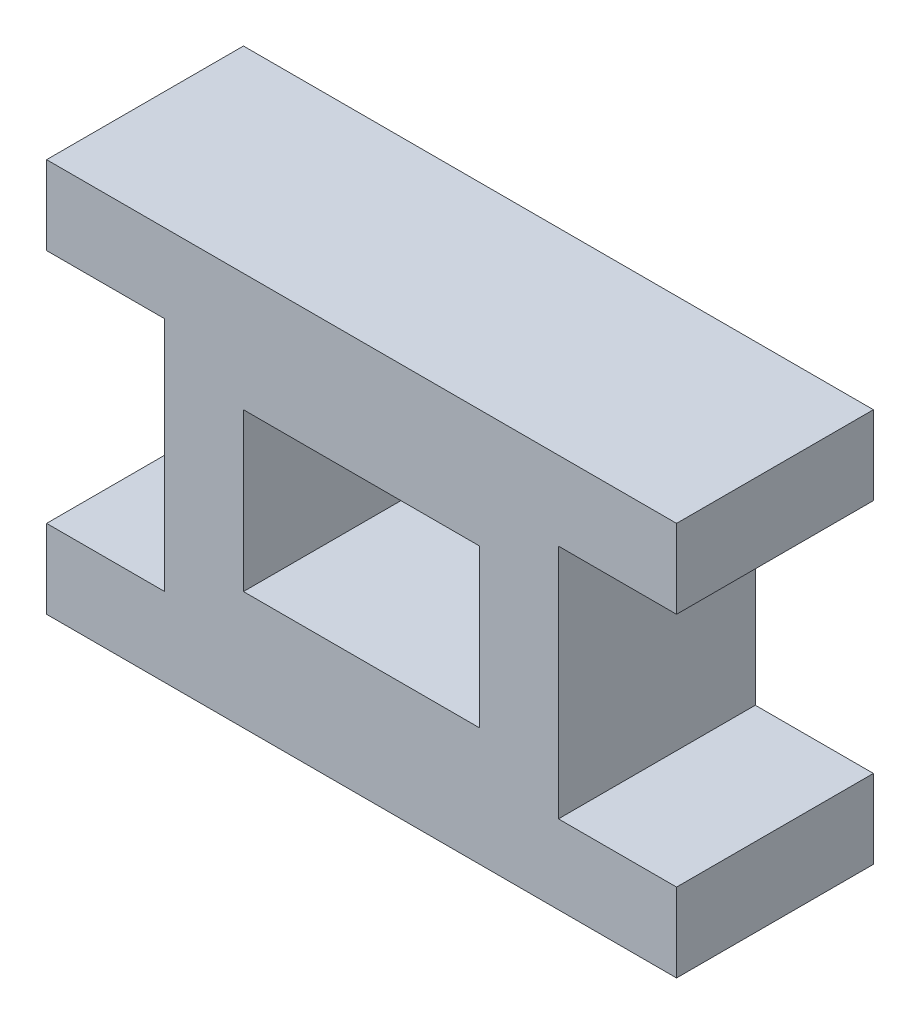
ISO-10303-21;
HEADER;
FILE_DESCRIPTION(('STEP AP214'),'2;1');
FILE_NAME('part.step','',(''),(''),'','','');
FILE_SCHEMA(('AUTOMOTIVE_DESIGN { 1 0 10303 214 1 1 1 1 }'));
ENDSEC;
DATA;
#1=APPLICATION_CONTEXT('core data for automotive mechanical design processes');
#2=APPLICATION_PROTOCOL_DEFINITION('international standard','automotive_design',2000,#1);
#3=PRODUCT_CONTEXT('',#1,'mechanical');
#4=PRODUCT('Part','Part','',(#3));
#5=PRODUCT_RELATED_PRODUCT_CATEGORY('part','',(#4));
#6=PRODUCT_DEFINITION_FORMATION('','',#4);
#7=PRODUCT_DEFINITION_CONTEXT('part definition',#1,'design');
#8=PRODUCT_DEFINITION('design','',#6,#7);
#9=PRODUCT_DEFINITION_SHAPE('','',#8);
#10=(LENGTH_UNIT() NAMED_UNIT(*) SI_UNIT(.MILLI.,.METRE.));
#11=(NAMED_UNIT(*) PLANE_ANGLE_UNIT() SI_UNIT($,.RADIAN.));
#12=(NAMED_UNIT(*) SI_UNIT($,.STERADIAN.) SOLID_ANGLE_UNIT());
#13=UNCERTAINTY_MEASURE_WITH_UNIT(LENGTH_MEASURE(1.E-05),#10,'distance_accuracy_value','');
#14=(GEOMETRIC_REPRESENTATION_CONTEXT(3) GLOBAL_UNCERTAINTY_ASSIGNED_CONTEXT((#13)) GLOBAL_UNIT_ASSIGNED_CONTEXT((#10,
#11,#12)) REPRESENTATION_CONTEXT('',''));
#15=CARTESIAN_POINT('',(0.,0.,0.));
#16=DIRECTION('',(0.,0.,1.));
#17=DIRECTION('',(1.,0.,0.));
#18=AXIS2_PLACEMENT_3D('',#15,#16,#17);
#19=CARTESIAN_POINT('',(0.,0.,25.));
#20=DIRECTION('',(0.,0.,-1.));
#21=DIRECTION('',(-1.,0.,0.));
#22=AXIS2_PLACEMENT_3D('',#19,#20,#21);
#23=PLANE('',#22);
#24=DIRECTION('',(-1.,0.,0.));
#25=VECTOR('',#24,1.);
#26=CARTESIAN_POINT('',(40.,-11.936936627637,25.));
#27=LINE('',#26,#25);
#28=CARTESIAN_POINT('',(40.,-11.936936627637,25.));
#29=VERTEX_POINT('',#28);
#30=CARTESIAN_POINT('',(25.,-11.936936627637,25.));
#31=VERTEX_POINT('',#30);
#32=EDGE_CURVE('E182',#29,#31,#27,.T.);
#33=ORIENTED_EDGE('',*,*,#32,.T.);
#34=DIRECTION('',(0.,1.,0.));
#35=VECTOR('',#34,1.);
#36=CARTESIAN_POINT('',(25.,-11.936936627637,25.));
#37=LINE('',#36,#35);
#38=CARTESIAN_POINT('',(25.,18.063063372363,25.));
#39=VERTEX_POINT('',#38);
#40=EDGE_CURVE('E185',#31,#39,#37,.T.);
#41=ORIENTED_EDGE('',*,*,#40,.T.);
#42=DIRECTION('',(1.,0.,0.));
#43=VECTOR('',#42,1.);
#44=CARTESIAN_POINT('',(25.,18.063063372363,25.));
#45=LINE('',#44,#43);
#46=CARTESIAN_POINT('',(40.,18.063063372363,25.));
#47=VERTEX_POINT('',#46);
#48=EDGE_CURVE('E188',#39,#47,#45,.T.);
#49=ORIENTED_EDGE('',*,*,#48,.T.);
#50=DIRECTION('',(0.,1.,0.));
#51=VECTOR('',#50,1.);
#52=CARTESIAN_POINT('',(40.,18.063063372363,25.));
#53=LINE('',#52,#51);
#54=CARTESIAN_POINT('',(40.,28.063063372363,25.));
#55=VERTEX_POINT('',#54);
#56=EDGE_CURVE('E190',#47,#55,#53,.T.);
#57=ORIENTED_EDGE('',*,*,#56,.T.);
#58=DIRECTION('',(-1.,0.,0.));
#59=VECTOR('',#58,1.);
#60=CARTESIAN_POINT('',(40.,28.063063372363,25.));
#61=LINE('',#60,#59);
#62=CARTESIAN_POINT('',(-40.,28.063063372363,25.));
#63=VERTEX_POINT('',#62);
#64=EDGE_CURVE('E192',#55,#63,#61,.T.);
#65=ORIENTED_EDGE('',*,*,#64,.T.);
#66=DIRECTION('',(0.,-1.,0.));
#67=VECTOR('',#66,1.);
#68=CARTESIAN_POINT('',(-40.,18.063063372363,25.));
#69=LINE('',#68,#67);
#70=CARTESIAN_POINT('',(-40.,18.063063372363,25.));
#71=VERTEX_POINT('',#70);
#72=EDGE_CURVE('E194',#63,#71,#69,.T.);
#73=ORIENTED_EDGE('',*,*,#72,.T.);
#74=DIRECTION('',(1.,0.,0.));
#75=VECTOR('',#74,1.);
#76=CARTESIAN_POINT('',(-25.,18.063063372363,25.));
#77=LINE('',#76,#75);
#78=CARTESIAN_POINT('',(-25.,18.063063372363,25.));
#79=VERTEX_POINT('',#78);
#80=EDGE_CURVE('E196',#71,#79,#77,.T.);
#81=ORIENTED_EDGE('',*,*,#80,.T.);
#82=DIRECTION('',(0.,-1.,0.));
#83=VECTOR('',#82,1.);
#84=CARTESIAN_POINT('',(-25.,-11.936936627637,25.));
#85=LINE('',#84,#83);
#86=CARTESIAN_POINT('',(-25.,-11.936936627637,25.));
#87=VERTEX_POINT('',#86);
#88=EDGE_CURVE('E198',#79,#87,#85,.T.);
#89=ORIENTED_EDGE('',*,*,#88,.T.);
#90=DIRECTION('',(-1.,0.,0.));
#91=VECTOR('',#90,1.);
#92=CARTESIAN_POINT('',(-40.,-11.936936627637,25.));
#93=LINE('',#92,#91);
#94=CARTESIAN_POINT('',(-40.,-11.936936627637,25.));
#95=VERTEX_POINT('',#94);
#96=EDGE_CURVE('E200',#87,#95,#93,.T.);
#97=ORIENTED_EDGE('',*,*,#96,.T.);
#98=DIRECTION('',(0.,-1.,0.));
#99=VECTOR('',#98,1.);
#100=CARTESIAN_POINT('',(-40.,-21.936936627637,25.));
#101=LINE('',#100,#99);
#102=CARTESIAN_POINT('',(-40.,-21.936936627637,25.));
#103=VERTEX_POINT('',#102);
#104=EDGE_CURVE('E202',#95,#103,#101,.T.);
#105=ORIENTED_EDGE('',*,*,#104,.T.);
#106=DIRECTION('',(1.,0.,0.));
#107=VECTOR('',#106,1.);
#108=CARTESIAN_POINT('',(-40.,-21.936936627637,25.));
#109=LINE('',#108,#107);
#110=CARTESIAN_POINT('',(40.,-21.936936627637,25.));
#111=VERTEX_POINT('',#110);
#112=EDGE_CURVE('E204',#103,#111,#109,.T.);
#113=ORIENTED_EDGE('',*,*,#112,.T.);
#114=DIRECTION('',(0.,1.,0.));
#115=VECTOR('',#114,1.);
#116=CARTESIAN_POINT('',(40.,-21.936936627637,25.));
#117=LINE('',#116,#115);
#118=EDGE_CURVE('E206',#111,#29,#117,.T.);
#119=ORIENTED_EDGE('',*,*,#118,.T.);
#120=EDGE_LOOP('',(#33,#41,#49,#57,#65,#73,#81,#89,#97,#105,#113,#119));
#121=FACE_BOUND('',#120,.T.);
#122=DIRECTION('',(0.,1.,0.));
#123=VECTOR('',#122,1.);
#124=CARTESIAN_POINT('',(15.,13.063063372363,25.));
#125=LINE('',#124,#123);
#126=CARTESIAN_POINT('',(15.,-6.93693662763698,25.));
#127=VERTEX_POINT('',#126);
#128=CARTESIAN_POINT('',(15.,13.063063372363,25.));
#129=VERTEX_POINT('',#128);
#130=EDGE_CURVE('E146',#127,#129,#125,.T.);
#131=ORIENTED_EDGE('',*,*,#130,.F.);
#132=DIRECTION('',(1.,0.,0.));
#133=VECTOR('',#132,1.);
#134=CARTESIAN_POINT('',(15.,-6.93693662763698,25.));
#135=LINE('',#134,#133);
#136=CARTESIAN_POINT('',(-15.,-6.93693662763699,25.));
#137=VERTEX_POINT('',#136);
#138=EDGE_CURVE('E168',#137,#127,#135,.T.);
#139=ORIENTED_EDGE('',*,*,#138,.F.);
#140=DIRECTION('',(0.,-1.,0.));
#141=VECTOR('',#140,1.);
#142=CARTESIAN_POINT('',(-15.,13.063063372363,25.));
#143=LINE('',#142,#141);
#144=CARTESIAN_POINT('',(-15.,13.063063372363,25.));
#145=VERTEX_POINT('',#144);
#146=EDGE_CURVE('E166',#145,#137,#143,.T.);
#147=ORIENTED_EDGE('',*,*,#146,.F.);
#148=DIRECTION('',(-1.,0.,0.));
#149=VECTOR('',#148,1.);
#150=CARTESIAN_POINT('',(-15.,13.063063372363,25.));
#151=LINE('',#150,#149);
#152=EDGE_CURVE('E154',#129,#145,#151,.T.);
#153=ORIENTED_EDGE('',*,*,#152,.F.);
#154=EDGE_LOOP('',(#131,#139,#147,#153));
#155=FACE_BOUND('',#154,.T.);
#156=ADVANCED_FACE('F33',(#121,#155),#23,.F.);
#157=CARTESIAN_POINT('',(0.,0.,0.));
#158=DIRECTION('',(0.,0.,-1.));
#159=DIRECTION('',(-1.,0.,0.));
#160=AXIS2_PLACEMENT_3D('',#157,#158,#159);
#161=PLANE('',#160);
#162=DIRECTION('',(-1.,0.,0.));
#163=VECTOR('',#162,1.);
#164=CARTESIAN_POINT('',(40.,-11.936936627637,0.));
#165=LINE('',#164,#163);
#166=CARTESIAN_POINT('',(40.,-11.936936627637,0.));
#167=VERTEX_POINT('',#166);
#168=CARTESIAN_POINT('',(25.,-11.936936627637,0.));
#169=VERTEX_POINT('',#168);
#170=EDGE_CURVE('E162',#167,#169,#165,.T.);
#171=ORIENTED_EDGE('',*,*,#170,.F.);
#172=DIRECTION('',(0.,1.,0.));
#173=VECTOR('',#172,1.);
#174=CARTESIAN_POINT('',(40.,-21.936936627637,0.));
#175=LINE('',#174,#173);
#176=CARTESIAN_POINT('',(40.,-21.936936627637,0.));
#177=VERTEX_POINT('',#176);
#178=EDGE_CURVE('E186',#177,#167,#175,.T.);
#179=ORIENTED_EDGE('',*,*,#178,.F.);
#180=DIRECTION('',(1.,0.,0.));
#181=VECTOR('',#180,1.);
#182=CARTESIAN_POINT('',(-40.,-21.936936627637,0.));
#183=LINE('',#182,#181);
#184=CARTESIAN_POINT('',(-40.,-21.936936627637,0.));
#185=VERTEX_POINT('',#184);
#186=EDGE_CURVE('E229',#185,#177,#183,.T.);
#187=ORIENTED_EDGE('',*,*,#186,.F.);
#188=DIRECTION('',(0.,-1.,0.));
#189=VECTOR('',#188,1.);
#190=CARTESIAN_POINT('',(-40.,-21.936936627637,0.));
#191=LINE('',#190,#189);
#192=CARTESIAN_POINT('',(-40.,-11.936936627637,0.));
#193=VERTEX_POINT('',#192);
#194=EDGE_CURVE('E227',#193,#185,#191,.T.);
#195=ORIENTED_EDGE('',*,*,#194,.F.);
#196=DIRECTION('',(-1.,0.,0.));
#197=VECTOR('',#196,1.);
#198=CARTESIAN_POINT('',(-40.,-11.936936627637,0.));
#199=LINE('',#198,#197);
#200=CARTESIAN_POINT('',(-25.,-11.936936627637,0.));
#201=VERTEX_POINT('',#200);
#202=EDGE_CURVE('E225',#201,#193,#199,.T.);
#203=ORIENTED_EDGE('',*,*,#202,.F.);
#204=DIRECTION('',(0.,-1.,0.));
#205=VECTOR('',#204,1.);
#206=CARTESIAN_POINT('',(-25.,-11.936936627637,0.));
#207=LINE('',#206,#205);
#208=CARTESIAN_POINT('',(-25.,18.063063372363,0.));
#209=VERTEX_POINT('',#208);
#210=EDGE_CURVE('E223',#209,#201,#207,.T.);
#211=ORIENTED_EDGE('',*,*,#210,.F.);
#212=DIRECTION('',(1.,0.,0.));
#213=VECTOR('',#212,1.);
#214=CARTESIAN_POINT('',(-25.,18.063063372363,0.));
#215=LINE('',#214,#213);
#216=CARTESIAN_POINT('',(-40.,18.063063372363,0.));
#217=VERTEX_POINT('',#216);
#218=EDGE_CURVE('E221',#217,#209,#215,.T.);
#219=ORIENTED_EDGE('',*,*,#218,.F.);
#220=DIRECTION('',(0.,-1.,0.));
#221=VECTOR('',#220,1.);
#222=CARTESIAN_POINT('',(-40.,18.063063372363,0.));
#223=LINE('',#222,#221);
#224=CARTESIAN_POINT('',(-40.,28.063063372363,0.));
#225=VERTEX_POINT('',#224);
#226=EDGE_CURVE('E219',#225,#217,#223,.T.);
#227=ORIENTED_EDGE('',*,*,#226,.F.);
#228=DIRECTION('',(-1.,0.,0.));
#229=VECTOR('',#228,1.);
#230=CARTESIAN_POINT('',(40.,28.063063372363,0.));
#231=LINE('',#230,#229);
#232=CARTESIAN_POINT('',(40.,28.063063372363,0.));
#233=VERTEX_POINT('',#232);
#234=EDGE_CURVE('E217',#233,#225,#231,.T.);
#235=ORIENTED_EDGE('',*,*,#234,.F.);
#236=DIRECTION('',(0.,1.,0.));
#237=VECTOR('',#236,1.);
#238=CARTESIAN_POINT('',(40.,18.063063372363,0.));
#239=LINE('',#238,#237);
#240=CARTESIAN_POINT('',(40.,18.063063372363,0.));
#241=VERTEX_POINT('',#240);
#242=EDGE_CURVE('E215',#241,#233,#239,.T.);
#243=ORIENTED_EDGE('',*,*,#242,.F.);
#244=DIRECTION('',(1.,0.,0.));
#245=VECTOR('',#244,1.);
#246=CARTESIAN_POINT('',(25.,18.063063372363,0.));
#247=LINE('',#246,#245);
#248=CARTESIAN_POINT('',(25.,18.063063372363,0.));
#249=VERTEX_POINT('',#248);
#250=EDGE_CURVE('E213',#249,#241,#247,.T.);
#251=ORIENTED_EDGE('',*,*,#250,.F.);
#252=DIRECTION('',(0.,1.,0.));
#253=VECTOR('',#252,1.);
#254=CARTESIAN_POINT('',(25.,-11.936936627637,0.));
#255=LINE('',#254,#253);
#256=EDGE_CURVE('E211',#169,#249,#255,.T.);
#257=ORIENTED_EDGE('',*,*,#256,.F.);
#258=EDGE_LOOP('',(#171,#179,#187,#195,#203,#211,#219,#227,#235,#243,#251,#257));
#259=FACE_BOUND('',#258,.T.);
#260=DIRECTION('',(1.,0.,0.));
#261=VECTOR('',#260,1.);
#262=CARTESIAN_POINT('',(15.,-6.93693662763698,0.));
#263=LINE('',#262,#261);
#264=CARTESIAN_POINT('',(-15.,-6.93693662763699,0.));
#265=VERTEX_POINT('',#264);
#266=CARTESIAN_POINT('',(15.,-6.93693662763698,0.));
#267=VERTEX_POINT('',#266);
#268=EDGE_CURVE('E155',#265,#267,#263,.T.);
#269=ORIENTED_EDGE('',*,*,#268,.T.);
#270=DIRECTION('',(0.,1.,0.));
#271=VECTOR('',#270,1.);
#272=CARTESIAN_POINT('',(15.,13.063063372363,0.));
#273=LINE('',#272,#271);
#274=CARTESIAN_POINT('',(15.,13.063063372363,0.));
#275=VERTEX_POINT('',#274);
#276=EDGE_CURVE('E56',#267,#275,#273,.T.);
#277=ORIENTED_EDGE('',*,*,#276,.T.);
#278=DIRECTION('',(-1.,0.,0.));
#279=VECTOR('',#278,1.);
#280=CARTESIAN_POINT('',(-15.,13.063063372363,0.));
#281=LINE('',#280,#279);
#282=CARTESIAN_POINT('',(-15.,13.063063372363,0.));
#283=VERTEX_POINT('',#282);
#284=EDGE_CURVE('E161',#275,#283,#281,.T.);
#285=ORIENTED_EDGE('',*,*,#284,.T.);
#286=DIRECTION('',(0.,-1.,0.));
#287=VECTOR('',#286,1.);
#288=CARTESIAN_POINT('',(-15.,13.063063372363,0.));
#289=LINE('',#288,#287);
#290=EDGE_CURVE('E174',#283,#265,#289,.T.);
#291=ORIENTED_EDGE('',*,*,#290,.T.);
#292=EDGE_LOOP('',(#269,#277,#285,#291));
#293=FACE_BOUND('',#292,.T.);
#294=ADVANCED_FACE('F271',(#259,#293),#161,.T.);
#295=CARTESIAN_POINT('',(40.,-11.936936627637,25.));
#296=DIRECTION('',(0.,-1.,0.));
#297=DIRECTION('',(1.,0.,0.));
#298=AXIS2_PLACEMENT_3D('',#295,#296,#297);
#299=PLANE('',#298);
#300=ORIENTED_EDGE('',*,*,#170,.T.);
#301=DIRECTION('',(0.,0.,-1.));
#302=VECTOR('',#301,1.);
#303=CARTESIAN_POINT('',(25.,-11.936936627637,25.));
#304=LINE('',#303,#302);
#305=EDGE_CURVE('E11',#31,#169,#304,.T.);
#306=ORIENTED_EDGE('',*,*,#305,.F.);
#307=ORIENTED_EDGE('',*,*,#32,.F.);
#308=DIRECTION('',(0.,0.,-1.));
#309=VECTOR('',#308,1.);
#310=CARTESIAN_POINT('',(40.,-11.936936627637,25.));
#311=LINE('',#310,#309);
#312=EDGE_CURVE('E208',#29,#167,#311,.T.);
#313=ORIENTED_EDGE('',*,*,#312,.T.);
#314=EDGE_LOOP('',(#300,#306,#307,#313));
#315=FACE_BOUND('',#314,.T.);
#316=ADVANCED_FACE('F35',(#315),#299,.F.);
#317=CARTESIAN_POINT('',(25.,-11.936936627637,25.));
#318=DIRECTION('',(-1.,0.,0.));
#319=DIRECTION('',(0.,0.,1.));
#320=AXIS2_PLACEMENT_3D('',#317,#318,#319);
#321=PLANE('',#320);
#322=ORIENTED_EDGE('',*,*,#256,.T.);
#323=DIRECTION('',(0.,0.,-1.));
#324=VECTOR('',#323,1.);
#325=CARTESIAN_POINT('',(25.,18.063063372363,25.));
#326=LINE('',#325,#324);
#327=EDGE_CURVE('E41',#39,#249,#326,.T.);
#328=ORIENTED_EDGE('',*,*,#327,.F.);
#329=ORIENTED_EDGE('',*,*,#40,.F.);
#330=ORIENTED_EDGE('',*,*,#305,.T.);
#331=EDGE_LOOP('',(#322,#328,#329,#330));
#332=FACE_BOUND('',#331,.T.);
#333=ADVANCED_FACE('F288',(#332),#321,.F.);
#334=CARTESIAN_POINT('',(25.,18.063063372363,25.));
#335=DIRECTION('',(0.,1.,0.));
#336=DIRECTION('',(-1.,0.,0.));
#337=AXIS2_PLACEMENT_3D('',#334,#335,#336);
#338=PLANE('',#337);
#339=ORIENTED_EDGE('',*,*,#250,.T.);
#340=DIRECTION('',(0.,0.,-1.));
#341=VECTOR('',#340,1.);
#342=CARTESIAN_POINT('',(40.,18.063063372363,25.));
#343=LINE('',#342,#341);
#344=EDGE_CURVE('E258',#47,#241,#343,.T.);
#345=ORIENTED_EDGE('',*,*,#344,.F.);
#346=ORIENTED_EDGE('',*,*,#48,.F.);
#347=ORIENTED_EDGE('',*,*,#327,.T.);
#348=EDGE_LOOP('',(#339,#345,#346,#347));
#349=FACE_BOUND('',#348,.T.);
#350=ADVANCED_FACE('F265',(#349),#338,.F.);
#351=CARTESIAN_POINT('',(40.,18.063063372363,25.));
#352=DIRECTION('',(-1.,0.,0.));
#353=DIRECTION('',(0.,0.,1.));
#354=AXIS2_PLACEMENT_3D('',#351,#352,#353);
#355=PLANE('',#354);
#356=ORIENTED_EDGE('',*,*,#242,.T.);
#357=DIRECTION('',(0.,0.,-1.));
#358=VECTOR('',#357,1.);
#359=CARTESIAN_POINT('',(40.,28.063063372363,25.));
#360=LINE('',#359,#358);
#361=EDGE_CURVE('E255',#55,#233,#360,.T.);
#362=ORIENTED_EDGE('',*,*,#361,.F.);
#363=ORIENTED_EDGE('',*,*,#56,.F.);
#364=ORIENTED_EDGE('',*,*,#344,.T.);
#365=EDGE_LOOP('',(#356,#362,#363,#364));
#366=FACE_BOUND('',#365,.T.);
#367=ADVANCED_FACE('F277',(#366),#355,.F.);
#368=CARTESIAN_POINT('',(40.,28.063063372363,25.));
#369=DIRECTION('',(0.,-1.,0.));
#370=DIRECTION('',(1.,0.,0.));
#371=AXIS2_PLACEMENT_3D('',#368,#369,#370);
#372=PLANE('',#371);
#373=ORIENTED_EDGE('',*,*,#234,.T.);
#374=DIRECTION('',(0.,0.,-1.));
#375=VECTOR('',#374,1.);
#376=CARTESIAN_POINT('',(-40.,28.063063372363,25.));
#377=LINE('',#376,#375);
#378=EDGE_CURVE('E252',#63,#225,#377,.T.);
#379=ORIENTED_EDGE('',*,*,#378,.F.);
#380=ORIENTED_EDGE('',*,*,#64,.F.);
#381=ORIENTED_EDGE('',*,*,#361,.T.);
#382=EDGE_LOOP('',(#373,#379,#380,#381));
#383=FACE_BOUND('',#382,.T.);
#384=ADVANCED_FACE('F281',(#383),#372,.F.);
#385=CARTESIAN_POINT('',(-40.,18.063063372363,25.));
#386=DIRECTION('',(1.,0.,0.));
#387=DIRECTION('',(0.,1.,0.));
#388=AXIS2_PLACEMENT_3D('',#385,#386,#387);
#389=PLANE('',#388);
#390=ORIENTED_EDGE('',*,*,#226,.T.);
#391=DIRECTION('',(0.,0.,-1.));
#392=VECTOR('',#391,1.);
#393=CARTESIAN_POINT('',(-40.,18.063063372363,25.));
#394=LINE('',#393,#392);
#395=EDGE_CURVE('E249',#71,#217,#394,.T.);
#396=ORIENTED_EDGE('',*,*,#395,.F.);
#397=ORIENTED_EDGE('',*,*,#72,.F.);
#398=ORIENTED_EDGE('',*,*,#378,.T.);
#399=EDGE_LOOP('',(#390,#396,#397,#398));
#400=FACE_BOUND('',#399,.T.);
#401=ADVANCED_FACE('F321',(#400),#389,.F.);
#402=CARTESIAN_POINT('',(-25.,18.063063372363,25.));
#403=DIRECTION('',(0.,1.,0.));
#404=DIRECTION('',(-1.,0.,0.));
#405=AXIS2_PLACEMENT_3D('',#402,#403,#404);
#406=PLANE('',#405);
#407=ORIENTED_EDGE('',*,*,#218,.T.);
#408=DIRECTION('',(0.,0.,-1.));
#409=VECTOR('',#408,1.);
#410=CARTESIAN_POINT('',(-25.,18.063063372363,25.));
#411=LINE('',#410,#409);
#412=EDGE_CURVE('E246',#79,#209,#411,.T.);
#413=ORIENTED_EDGE('',*,*,#412,.F.);
#414=ORIENTED_EDGE('',*,*,#80,.F.);
#415=ORIENTED_EDGE('',*,*,#395,.T.);
#416=EDGE_LOOP('',(#407,#413,#414,#415));
#417=FACE_BOUND('',#416,.T.);
#418=ADVANCED_FACE('F319',(#417),#406,.F.);
#419=CARTESIAN_POINT('',(-25.,-11.936936627637,25.));
#420=DIRECTION('',(1.,0.,0.));
#421=DIRECTION('',(0.,1.,0.));
#422=AXIS2_PLACEMENT_3D('',#419,#420,#421);
#423=PLANE('',#422);
#424=ORIENTED_EDGE('',*,*,#210,.T.);
#425=DIRECTION('',(0.,0.,-1.));
#426=VECTOR('',#425,1.);
#427=CARTESIAN_POINT('',(-25.,-11.936936627637,25.));
#428=LINE('',#427,#426);
#429=EDGE_CURVE('E243',#87,#201,#428,.T.);
#430=ORIENTED_EDGE('',*,*,#429,.F.);
#431=ORIENTED_EDGE('',*,*,#88,.F.);
#432=ORIENTED_EDGE('',*,*,#412,.T.);
#433=EDGE_LOOP('',(#424,#430,#431,#432));
#434=FACE_BOUND('',#433,.T.);
#435=ADVANCED_FACE('F315',(#434),#423,.F.);
#436=CARTESIAN_POINT('',(-40.,-11.936936627637,25.));
#437=DIRECTION('',(0.,-1.,0.));
#438=DIRECTION('',(1.,0.,0.));
#439=AXIS2_PLACEMENT_3D('',#436,#437,#438);
#440=PLANE('',#439);
#441=ORIENTED_EDGE('',*,*,#202,.T.);
#442=DIRECTION('',(0.,0.,-1.));
#443=VECTOR('',#442,1.);
#444=CARTESIAN_POINT('',(-40.,-11.936936627637,25.));
#445=LINE('',#444,#443);
#446=EDGE_CURVE('E240',#95,#193,#445,.T.);
#447=ORIENTED_EDGE('',*,*,#446,.F.);
#448=ORIENTED_EDGE('',*,*,#96,.F.);
#449=ORIENTED_EDGE('',*,*,#429,.T.);
#450=EDGE_LOOP('',(#441,#447,#448,#449));
#451=FACE_BOUND('',#450,.T.);
#452=ADVANCED_FACE('F310',(#451),#440,.F.);
#453=CARTESIAN_POINT('',(-40.,-21.936936627637,25.));
#454=DIRECTION('',(1.,0.,0.));
#455=DIRECTION('',(0.,0.,-1.));
#456=AXIS2_PLACEMENT_3D('',#453,#454,#455);
#457=PLANE('',#456);
#458=ORIENTED_EDGE('',*,*,#194,.T.);
#459=DIRECTION('',(0.,0.,-1.));
#460=VECTOR('',#459,1.);
#461=CARTESIAN_POINT('',(-40.,-21.936936627637,25.));
#462=LINE('',#461,#460);
#463=EDGE_CURVE('E237',#103,#185,#462,.T.);
#464=ORIENTED_EDGE('',*,*,#463,.F.);
#465=ORIENTED_EDGE('',*,*,#104,.F.);
#466=ORIENTED_EDGE('',*,*,#446,.T.);
#467=EDGE_LOOP('',(#458,#464,#465,#466));
#468=FACE_BOUND('',#467,.T.);
#469=ADVANCED_FACE('F304',(#468),#457,.F.);
#470=CARTESIAN_POINT('',(-40.,-21.936936627637,25.));
#471=DIRECTION('',(0.,1.,0.));
#472=DIRECTION('',(-1.,0.,0.));
#473=AXIS2_PLACEMENT_3D('',#470,#471,#472);
#474=PLANE('',#473);
#475=ORIENTED_EDGE('',*,*,#186,.T.);
#476=DIRECTION('',(0.,0.,-1.));
#477=VECTOR('',#476,1.);
#478=CARTESIAN_POINT('',(40.,-21.936936627637,25.));
#479=LINE('',#478,#477);
#480=EDGE_CURVE('E234',#111,#177,#479,.T.);
#481=ORIENTED_EDGE('',*,*,#480,.F.);
#482=ORIENTED_EDGE('',*,*,#112,.F.);
#483=ORIENTED_EDGE('',*,*,#463,.T.);
#484=EDGE_LOOP('',(#475,#481,#482,#483));
#485=FACE_BOUND('',#484,.T.);
#486=ADVANCED_FACE('F300',(#485),#474,.F.);
#487=CARTESIAN_POINT('',(40.,-21.936936627637,25.));
#488=DIRECTION('',(-1.,0.,0.));
#489=DIRECTION('',(0.,0.,1.));
#490=AXIS2_PLACEMENT_3D('',#487,#488,#489);
#491=PLANE('',#490);
#492=ORIENTED_EDGE('',*,*,#178,.T.);
#493=ORIENTED_EDGE('',*,*,#312,.F.);
#494=ORIENTED_EDGE('',*,*,#118,.F.);
#495=ORIENTED_EDGE('',*,*,#480,.T.);
#496=EDGE_LOOP('',(#492,#493,#494,#495));
#497=FACE_BOUND('',#496,.T.);
#498=ADVANCED_FACE('F295',(#497),#491,.F.);
#499=CARTESIAN_POINT('',(15.,13.063063372363,25.));
#500=DIRECTION('',(-1.,0.,0.));
#501=DIRECTION('',(0.,-1.,0.));
#502=AXIS2_PLACEMENT_3D('',#499,#500,#501);
#503=PLANE('',#502);
#504=ORIENTED_EDGE('',*,*,#276,.F.);
#505=DIRECTION('',(0.,0.,-1.));
#506=VECTOR('',#505,1.);
#507=CARTESIAN_POINT('',(15.,-6.93693662763698,25.));
#508=LINE('',#507,#506);
#509=EDGE_CURVE('E150',#127,#267,#508,.T.);
#510=ORIENTED_EDGE('',*,*,#509,.F.);
#511=ORIENTED_EDGE('',*,*,#130,.T.);
#512=DIRECTION('',(0.,0.,-1.));
#513=VECTOR('',#512,1.);
#514=CARTESIAN_POINT('',(15.,13.063063372363,25.));
#515=LINE('',#514,#513);
#516=EDGE_CURVE('E149',#129,#275,#515,.T.);
#517=ORIENTED_EDGE('',*,*,#516,.T.);
#518=EDGE_LOOP('',(#504,#510,#511,#517));
#519=FACE_BOUND('',#518,.T.);
#520=ADVANCED_FACE('F148',(#519),#503,.T.);
#521=CARTESIAN_POINT('',(-15.,13.063063372363,25.));
#522=DIRECTION('',(0.,-1.,0.));
#523=DIRECTION('',(1.,0.,0.));
#524=AXIS2_PLACEMENT_3D('',#521,#522,#523);
#525=PLANE('',#524);
#526=ORIENTED_EDGE('',*,*,#284,.F.);
#527=ORIENTED_EDGE('',*,*,#516,.F.);
#528=ORIENTED_EDGE('',*,*,#152,.T.);
#529=DIRECTION('',(0.,0.,-1.));
#530=VECTOR('',#529,1.);
#531=CARTESIAN_POINT('',(-15.,13.063063372363,25.));
#532=LINE('',#531,#530);
#533=EDGE_CURVE('E163',#145,#283,#532,.T.);
#534=ORIENTED_EDGE('',*,*,#533,.T.);
#535=EDGE_LOOP('',(#526,#527,#528,#534));
#536=FACE_BOUND('',#535,.T.);
#537=ADVANCED_FACE('F158',(#536),#525,.T.);
#538=CARTESIAN_POINT('',(-15.,13.063063372363,25.));
#539=DIRECTION('',(1.,0.,0.));
#540=DIRECTION('',(0.,1.,0.));
#541=AXIS2_PLACEMENT_3D('',#538,#539,#540);
#542=PLANE('',#541);
#543=ORIENTED_EDGE('',*,*,#290,.F.);
#544=ORIENTED_EDGE('',*,*,#533,.F.);
#545=ORIENTED_EDGE('',*,*,#146,.T.);
#546=DIRECTION('',(0.,0.,-1.));
#547=VECTOR('',#546,1.);
#548=CARTESIAN_POINT('',(-15.,-6.93693662763699,25.));
#549=LINE('',#548,#547);
#550=EDGE_CURVE('E48',#137,#265,#549,.T.);
#551=ORIENTED_EDGE('',*,*,#550,.T.);
#552=EDGE_LOOP('',(#543,#544,#545,#551));
#553=FACE_BOUND('',#552,.T.);
#554=ADVANCED_FACE('F379',(#553),#542,.T.);
#555=CARTESIAN_POINT('',(15.,-6.93693662763698,25.));
#556=DIRECTION('',(0.,1.,0.));
#557=DIRECTION('',(-1.,0.,0.));
#558=AXIS2_PLACEMENT_3D('',#555,#556,#557);
#559=PLANE('',#558);
#560=ORIENTED_EDGE('',*,*,#268,.F.);
#561=ORIENTED_EDGE('',*,*,#550,.F.);
#562=ORIENTED_EDGE('',*,*,#138,.T.);
#563=ORIENTED_EDGE('',*,*,#509,.T.);
#564=EDGE_LOOP('',(#560,#561,#562,#563));
#565=FACE_BOUND('',#564,.T.);
#566=ADVANCED_FACE('F385',(#565),#559,.T.);
#567=CLOSED_SHELL('',(#156,#294,#316,#333,#350,#367,#384,#401,#418,#435,#452,#469,#486,#498,
#520,#537,#554,#566));
#568=MANIFOLD_SOLID_BREP('B2',#567);
#569=ADVANCED_BREP_SHAPE_REPRESENTATION('',(#18,#568),#14);
#570=SHAPE_DEFINITION_REPRESENTATION(#9,#569);
ENDSEC;
END-ISO-10303-21;
